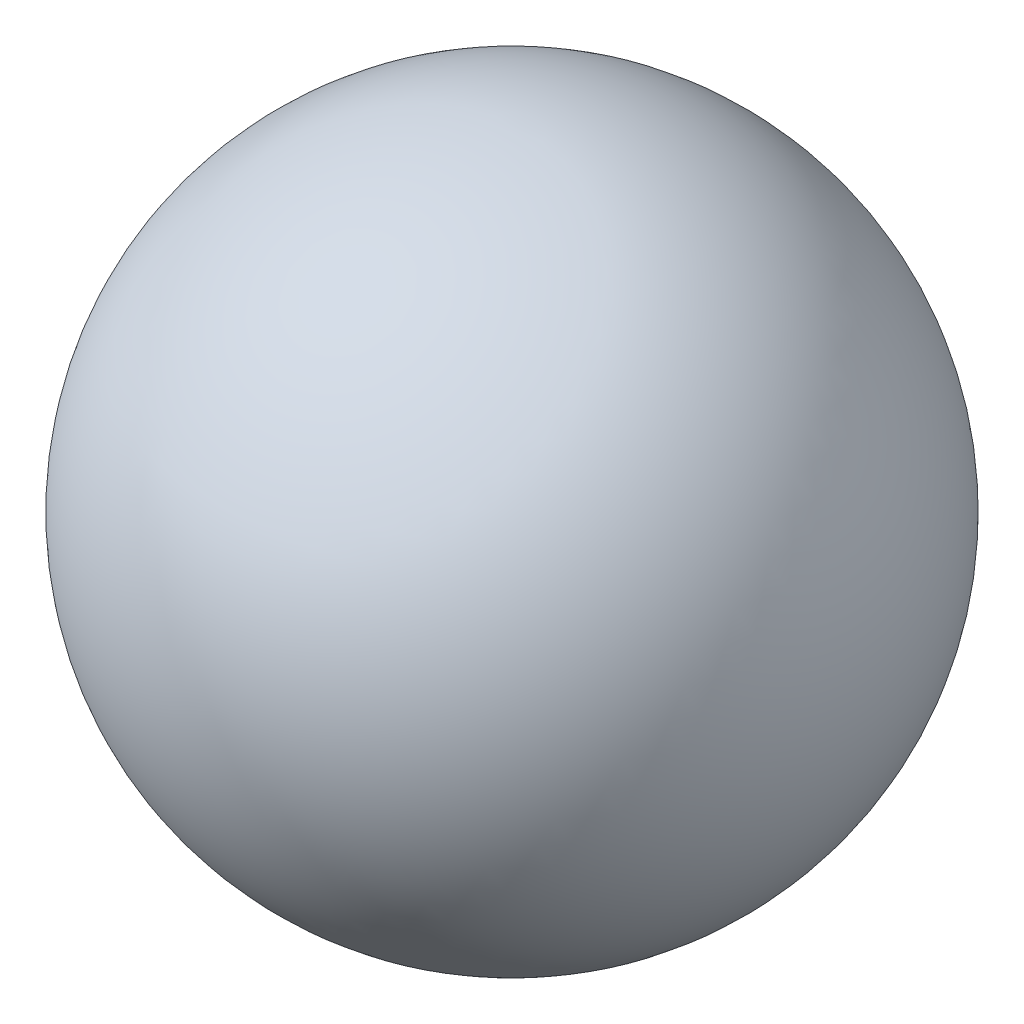
ISO-10303-21;
HEADER;
FILE_DESCRIPTION(('STEP AP214'),'2;1');
FILE_NAME('part.step','',(''),(''),'','','');
FILE_SCHEMA(('AUTOMOTIVE_DESIGN { 1 0 10303 214 1 1 1 1 }'));
ENDSEC;
DATA;
#1=APPLICATION_CONTEXT('core data for automotive mechanical design processes');
#2=APPLICATION_PROTOCOL_DEFINITION('international standard','automotive_design',2000,#1);
#3=PRODUCT_CONTEXT('',#1,'mechanical');
#4=PRODUCT('Part','Part','',(#3));
#5=PRODUCT_RELATED_PRODUCT_CATEGORY('part','',(#4));
#6=PRODUCT_DEFINITION_FORMATION('','',#4);
#7=PRODUCT_DEFINITION_CONTEXT('part definition',#1,'design');
#8=PRODUCT_DEFINITION('design','',#6,#7);
#9=PRODUCT_DEFINITION_SHAPE('','',#8);
#10=(LENGTH_UNIT() NAMED_UNIT(*) SI_UNIT(.MILLI.,.METRE.));
#11=(NAMED_UNIT(*) PLANE_ANGLE_UNIT() SI_UNIT($,.RADIAN.));
#12=(NAMED_UNIT(*) SI_UNIT($,.STERADIAN.) SOLID_ANGLE_UNIT());
#13=UNCERTAINTY_MEASURE_WITH_UNIT(LENGTH_MEASURE(1.E-05),#10,'distance_accuracy_value','');
#14=(GEOMETRIC_REPRESENTATION_CONTEXT(3) GLOBAL_UNCERTAINTY_ASSIGNED_CONTEXT((#13)) GLOBAL_UNIT_ASSIGNED_CONTEXT((#10,
#11,#12)) REPRESENTATION_CONTEXT('',''));
#15=CARTESIAN_POINT('',(0.,0.,0.));
#16=DIRECTION('',(0.,0.,1.));
#17=DIRECTION('',(1.,0.,0.));
#18=AXIS2_PLACEMENT_3D('',#15,#16,#17);
#19=CARTESIAN_POINT('',(0.,0.,0.));
#20=DIRECTION('',(0.,1.,0.));
#21=DIRECTION('',(0.,0.,-1.));
#22=AXIS2_PLACEMENT_3D('',#19,#20,#21);
#23=SPHERICAL_SURFACE('',#22,21.5);
#24=CARTESIAN_POINT('',(0.,21.5,0.));
#25=VERTEX_POINT('',#24);
#26=VERTEX_LOOP('',#25);
#27=FACE_BOUND('',#26,.T.);
#28=ADVANCED_FACE('F29',(#27),#23,.T.);
#29=CLOSED_SHELL('',(#28));
#30=MANIFOLD_SOLID_BREP('B2',#29);
#31=ADVANCED_BREP_SHAPE_REPRESENTATION('',(#18,#30),#14);
#32=SHAPE_DEFINITION_REPRESENTATION(#9,#31);
ENDSEC;
END-ISO-10303-21;
